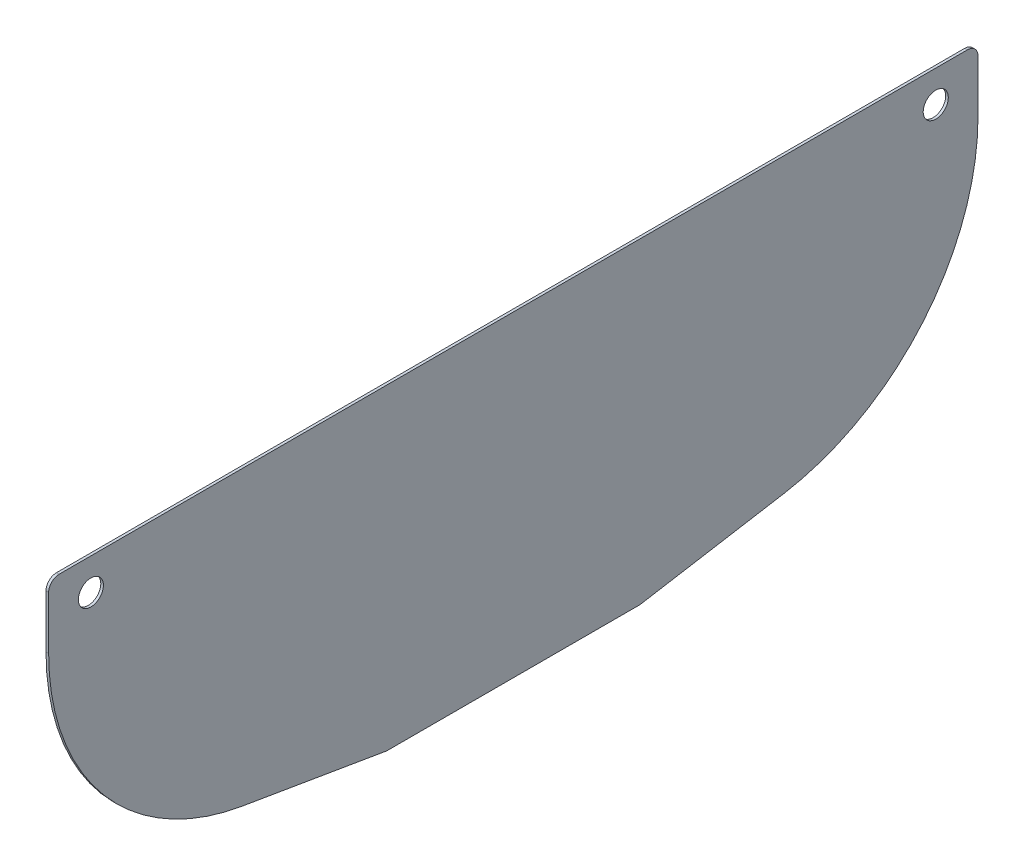
ISO-10303-21;
HEADER;
FILE_DESCRIPTION(('STEP AP214'),'2;1');
FILE_NAME('part.step','',(''),(''),'','','');
FILE_SCHEMA(('AUTOMOTIVE_DESIGN { 1 0 10303 214 1 1 1 1 }'));
ENDSEC;
DATA;
#1=APPLICATION_CONTEXT('core data for automotive mechanical design processes');
#2=APPLICATION_PROTOCOL_DEFINITION('international standard','automotive_design',2000,#1);
#3=PRODUCT_CONTEXT('',#1,'mechanical');
#4=PRODUCT('Part','Part','',(#3));
#5=PRODUCT_RELATED_PRODUCT_CATEGORY('part','',(#4));
#6=PRODUCT_DEFINITION_FORMATION('','',#4);
#7=PRODUCT_DEFINITION_CONTEXT('part definition',#1,'design');
#8=PRODUCT_DEFINITION('design','',#6,#7);
#9=PRODUCT_DEFINITION_SHAPE('','',#8);
#10=(LENGTH_UNIT() NAMED_UNIT(*) SI_UNIT(.MILLI.,.METRE.));
#11=(NAMED_UNIT(*) PLANE_ANGLE_UNIT() SI_UNIT($,.RADIAN.));
#12=(NAMED_UNIT(*) SI_UNIT($,.STERADIAN.) SOLID_ANGLE_UNIT());
#13=UNCERTAINTY_MEASURE_WITH_UNIT(LENGTH_MEASURE(1.E-05),#10,'distance_accuracy_value','');
#14=(GEOMETRIC_REPRESENTATION_CONTEXT(3) GLOBAL_UNCERTAINTY_ASSIGNED_CONTEXT((#13)) GLOBAL_UNIT_ASSIGNED_CONTEXT((#10,
#11,#12)) REPRESENTATION_CONTEXT('',''));
#15=CARTESIAN_POINT('',(0.,0.,0.));
#16=DIRECTION('',(0.,0.,1.));
#17=DIRECTION('',(1.,0.,0.));
#18=AXIS2_PLACEMENT_3D('',#15,#16,#17);
#19=CARTESIAN_POINT('',(3.175,609.6,-279.4));
#20=DIRECTION('',(1.,0.,0.));
#21=DIRECTION('',(0.,0.,-1.));
#22=AXIS2_PLACEMENT_3D('',#19,#20,#21);
#23=PLANE('',#22);
#24=CARTESIAN_POINT('',(3.175,647.7,508.));
#25=DIRECTION('',(1.,0.,0.));
#26=DIRECTION('',(0.,0.,-1.));
#27=AXIS2_PLACEMENT_3D('',#24,#25,#26);
#28=CIRCLE('',#27,15.08125);
#29=CARTESIAN_POINT('',(3.175,647.7,492.91875));
#30=VERTEX_POINT('',#29);
#31=EDGE_CURVE('E243',#30,#30,#28,.T.);
#32=ORIENTED_EDGE('',*,*,#31,.F.);
#33=EDGE_LOOP('',(#32));
#34=FACE_BOUND('',#33,.T.);
#35=DIRECTION('',(0.,0.,-1.));
#36=VECTOR('',#35,1.);
#37=CARTESIAN_POINT('',(3.175,304.8,-152.4));
#38=LINE('',#37,#36);
#39=CARTESIAN_POINT('',(3.175,304.8,151.335296477196));
#40=VERTEX_POINT('',#39);
#41=CARTESIAN_POINT('',(3.175,304.8,-151.335296477196));
#42=VERTEX_POINT('',#41);
#43=EDGE_CURVE('E236',#40,#42,#38,.T.);
#44=ORIENTED_EDGE('',*,*,#43,.T.);
#45=CARTESIAN_POINT('',(3.175,317.5,-151.335296477196));
#46=DIRECTION('',(1.,0.,0.));
#47=DIRECTION('',(0.,0.,-1.));
#48=AXIS2_PLACEMENT_3D('',#45,#46,#47);
#49=CIRCLE('',#48,12.7);
#50=CARTESIAN_POINT('',(3.175,304.977272750754,-153.449841875385));
#51=VERTEX_POINT('',#50);
#52=EDGE_CURVE('E182',#42,#51,#49,.T.);
#53=ORIENTED_EDGE('',*,*,#52,.T.);
#54=DIRECTION('',(0.,0.166499637652699,-0.986041515688625));
#55=VECTOR('',#54,1.);
#56=CARTESIAN_POINT('',(3.175,304.8,-152.4));
#57=LINE('',#56,#55);
#58=CARTESIAN_POINT('',(3.175,334.100000516598,-325.919998760164));
#59=VERTEX_POINT('',#58);
#60=EDGE_CURVE('E145',#51,#59,#57,.T.);
#61=ORIENTED_EDGE('',*,*,#60,.T.);
#62=CARTESIAN_POINT('',(3.175,609.6,-279.4));
#63=DIRECTION('',(1.,0.,0.));
#64=DIRECTION('',(0.,0.,-1.));
#65=AXIS2_PLACEMENT_3D('',#62,#63,#64);
#66=CIRCLE('',#65,279.4);
#67=CARTESIAN_POINT('',(3.175,609.6,-558.8));
#68=VERTEX_POINT('',#67);
#69=EDGE_CURVE('E139',#59,#68,#66,.T.);
#70=ORIENTED_EDGE('',*,*,#69,.T.);
#71=DIRECTION('',(0.,1.,0.));
#72=VECTOR('',#71,1.);
#73=CARTESIAN_POINT('',(3.175,685.8,-558.8));
#74=LINE('',#73,#72);
#75=CARTESIAN_POINT('',(3.175,673.1,-558.8));
#76=VERTEX_POINT('',#75);
#77=EDGE_CURVE('E129',#68,#76,#74,.T.);
#78=ORIENTED_EDGE('',*,*,#77,.T.);
#79=CARTESIAN_POINT('',(3.175,673.1,-546.1));
#80=DIRECTION('',(1.,0.,0.));
#81=DIRECTION('',(0.,0.,-1.));
#82=AXIS2_PLACEMENT_3D('',#79,#80,#81);
#83=CIRCLE('',#82,12.7);
#84=CARTESIAN_POINT('',(3.175,685.8,-546.1));
#85=VERTEX_POINT('',#84);
#86=EDGE_CURVE('E178',#76,#85,#83,.T.);
#87=ORIENTED_EDGE('',*,*,#86,.T.);
#88=DIRECTION('',(0.,0.,1.));
#89=VECTOR('',#88,1.);
#90=CARTESIAN_POINT('',(3.175,685.8,558.8));
#91=LINE('',#90,#89);
#92=CARTESIAN_POINT('',(3.175,685.8,546.1));
#93=VERTEX_POINT('',#92);
#94=EDGE_CURVE('E138',#85,#93,#91,.T.);
#95=ORIENTED_EDGE('',*,*,#94,.T.);
#96=CARTESIAN_POINT('',(3.175,673.1,546.1));
#97=DIRECTION('',(1.,0.,0.));
#98=DIRECTION('',(0.,0.,-1.));
#99=AXIS2_PLACEMENT_3D('',#96,#97,#98);
#100=CIRCLE('',#99,12.7);
#101=CARTESIAN_POINT('',(3.175,673.1,558.8));
#102=VERTEX_POINT('',#101);
#103=EDGE_CURVE('E60',#93,#102,#100,.T.);
#104=ORIENTED_EDGE('',*,*,#103,.T.);
#105=DIRECTION('',(0.,-1.,0.));
#106=VECTOR('',#105,1.);
#107=CARTESIAN_POINT('',(3.175,609.6,558.8));
#108=LINE('',#107,#106);
#109=CARTESIAN_POINT('',(3.175,609.6,558.8));
#110=VERTEX_POINT('',#109);
#111=EDGE_CURVE('E257',#102,#110,#108,.T.);
#112=ORIENTED_EDGE('',*,*,#111,.T.);
#113=CARTESIAN_POINT('',(3.175,609.6,279.4));
#114=DIRECTION('',(1.,0.,0.));
#115=DIRECTION('',(0.,0.,1.));
#116=AXIS2_PLACEMENT_3D('',#113,#114,#115);
#117=CIRCLE('',#116,279.4);
#118=CARTESIAN_POINT('',(3.175,334.100000516598,325.919998760164));
#119=VERTEX_POINT('',#118);
#120=EDGE_CURVE('E240',#110,#119,#117,.T.);
#121=ORIENTED_EDGE('',*,*,#120,.T.);
#122=DIRECTION('',(0.,-0.166499637652699,-0.986041515688625));
#123=VECTOR('',#122,1.);
#124=CARTESIAN_POINT('',(3.175,304.8,152.4));
#125=LINE('',#124,#123);
#126=CARTESIAN_POINT('',(3.175,304.977272750754,153.449841875385));
#127=VERTEX_POINT('',#126);
#128=EDGE_CURVE('E223',#119,#127,#125,.T.);
#129=ORIENTED_EDGE('',*,*,#128,.T.);
#130=CARTESIAN_POINT('',(3.175,317.5,151.335296477196));
#131=DIRECTION('',(1.,0.,0.));
#132=DIRECTION('',(0.,0.,-1.));
#133=AXIS2_PLACEMENT_3D('',#130,#131,#132);
#134=CIRCLE('',#133,12.7);
#135=EDGE_CURVE('E180',#127,#40,#134,.T.);
#136=ORIENTED_EDGE('',*,*,#135,.T.);
#137=EDGE_LOOP('',(#44,#53,#61,#70,#78,#87,#95,#104,#112,#121,#129,#136));
#138=FACE_BOUND('',#137,.T.);
#139=CARTESIAN_POINT('',(3.175,647.7,-508.));
#140=DIRECTION('',(1.,0.,0.));
#141=DIRECTION('',(0.,0.,-1.));
#142=AXIS2_PLACEMENT_3D('',#139,#140,#141);
#143=CIRCLE('',#142,15.0812500000001);
#144=CARTESIAN_POINT('',(3.175,647.7,-523.08125));
#145=VERTEX_POINT('',#144);
#146=EDGE_CURVE('E250',#145,#145,#143,.T.);
#147=ORIENTED_EDGE('',*,*,#146,.F.);
#148=EDGE_LOOP('',(#147));
#149=FACE_BOUND('',#148,.T.);
#150=ADVANCED_FACE('F37',(#34,#138,#149),#23,.T.);
#151=CARTESIAN_POINT('',(0.,609.6,-279.4));
#152=DIRECTION('',(1.,0.,0.));
#153=DIRECTION('',(0.,0.,-1.));
#154=AXIS2_PLACEMENT_3D('',#151,#152,#153);
#155=PLANE('',#154);
#156=DIRECTION('',(0.,0.166499637652699,-0.986041515688625));
#157=VECTOR('',#156,1.);
#158=CARTESIAN_POINT('',(0.,304.8,-152.4));
#159=LINE('',#158,#157);
#160=CARTESIAN_POINT('',(0.,304.977272750754,-153.449841875385));
#161=VERTEX_POINT('',#160);
#162=CARTESIAN_POINT('',(0.,334.100000516598,-325.919998760164));
#163=VERTEX_POINT('',#162);
#164=EDGE_CURVE('E149',#161,#163,#159,.T.);
#165=ORIENTED_EDGE('',*,*,#164,.F.);
#166=CARTESIAN_POINT('',(0.,317.5,-151.335296477196));
#167=DIRECTION('',(1.,0.,0.));
#168=DIRECTION('',(0.,0.,-1.));
#169=AXIS2_PLACEMENT_3D('',#166,#167,#168);
#170=CIRCLE('',#169,12.7);
#171=CARTESIAN_POINT('',(0.,304.8,-151.335296477196));
#172=VERTEX_POINT('',#171);
#173=EDGE_CURVE('E170',#161,#172,#170,.F.);
#174=ORIENTED_EDGE('',*,*,#173,.T.);
#175=DIRECTION('',(0.,0.,-1.));
#176=VECTOR('',#175,1.);
#177=CARTESIAN_POINT('',(0.,304.8,-152.4));
#178=LINE('',#177,#176);
#179=CARTESIAN_POINT('',(0.,304.8,151.335296477196));
#180=VERTEX_POINT('',#179);
#181=EDGE_CURVE('E214',#180,#172,#178,.T.);
#182=ORIENTED_EDGE('',*,*,#181,.F.);
#183=CARTESIAN_POINT('',(0.,317.5,151.335296477196));
#184=DIRECTION('',(1.,0.,0.));
#185=DIRECTION('',(0.,0.,-1.));
#186=AXIS2_PLACEMENT_3D('',#183,#184,#185);
#187=CIRCLE('',#186,12.7);
#188=CARTESIAN_POINT('',(0.,304.977272750754,153.449841875385));
#189=VERTEX_POINT('',#188);
#190=EDGE_CURVE('E168',#180,#189,#187,.F.);
#191=ORIENTED_EDGE('',*,*,#190,.T.);
#192=DIRECTION('',(0.,-0.166499637652699,-0.986041515688625));
#193=VECTOR('',#192,1.);
#194=CARTESIAN_POINT('',(0.,304.8,152.4));
#195=LINE('',#194,#193);
#196=CARTESIAN_POINT('',(0.,334.100000516598,325.919998760164));
#197=VERTEX_POINT('',#196);
#198=EDGE_CURVE('E212',#197,#189,#195,.T.);
#199=ORIENTED_EDGE('',*,*,#198,.F.);
#200=CARTESIAN_POINT('',(0.,609.6,279.4));
#201=DIRECTION('',(1.,0.,0.));
#202=DIRECTION('',(0.,0.,1.));
#203=AXIS2_PLACEMENT_3D('',#200,#201,#202);
#204=CIRCLE('',#203,279.4);
#205=CARTESIAN_POINT('',(0.,609.6,558.8));
#206=VERTEX_POINT('',#205);
#207=EDGE_CURVE('E206',#206,#197,#204,.T.);
#208=ORIENTED_EDGE('',*,*,#207,.F.);
#209=DIRECTION('',(0.,-1.,0.));
#210=VECTOR('',#209,1.);
#211=CARTESIAN_POINT('',(0.,609.6,558.8));
#212=LINE('',#211,#210);
#213=CARTESIAN_POINT('',(0.,673.1,558.8));
#214=VERTEX_POINT('',#213);
#215=EDGE_CURVE('E203',#214,#206,#212,.T.);
#216=ORIENTED_EDGE('',*,*,#215,.F.);
#217=CARTESIAN_POINT('',(0.,673.1,546.1));
#218=DIRECTION('',(1.,0.,0.));
#219=DIRECTION('',(0.,0.,-1.));
#220=AXIS2_PLACEMENT_3D('',#217,#218,#219);
#221=CIRCLE('',#220,12.7);
#222=CARTESIAN_POINT('',(0.,685.8,546.1));
#223=VERTEX_POINT('',#222);
#224=EDGE_CURVE('E158',#214,#223,#221,.F.);
#225=ORIENTED_EDGE('',*,*,#224,.T.);
#226=DIRECTION('',(0.,0.,1.));
#227=VECTOR('',#226,1.);
#228=CARTESIAN_POINT('',(0.,685.8,558.8));
#229=LINE('',#228,#227);
#230=CARTESIAN_POINT('',(0.,685.8,-546.1));
#231=VERTEX_POINT('',#230);
#232=EDGE_CURVE('E195',#231,#223,#229,.T.);
#233=ORIENTED_EDGE('',*,*,#232,.F.);
#234=CARTESIAN_POINT('',(0.,673.1,-546.1));
#235=DIRECTION('',(1.,0.,0.));
#236=DIRECTION('',(0.,0.,-1.));
#237=AXIS2_PLACEMENT_3D('',#234,#235,#236);
#238=CIRCLE('',#237,12.7);
#239=CARTESIAN_POINT('',(0.,673.1,-558.8));
#240=VERTEX_POINT('',#239);
#241=EDGE_CURVE('E166',#231,#240,#238,.F.);
#242=ORIENTED_EDGE('',*,*,#241,.T.);
#243=DIRECTION('',(0.,1.,0.));
#244=VECTOR('',#243,1.);
#245=CARTESIAN_POINT('',(0.,685.8,-558.8));
#246=LINE('',#245,#244);
#247=CARTESIAN_POINT('',(0.,609.6,-558.8));
#248=VERTEX_POINT('',#247);
#249=EDGE_CURVE('E204',#248,#240,#246,.T.);
#250=ORIENTED_EDGE('',*,*,#249,.F.);
#251=CARTESIAN_POINT('',(0.,609.6,-279.4));
#252=DIRECTION('',(1.,0.,0.));
#253=DIRECTION('',(0.,0.,-1.));
#254=AXIS2_PLACEMENT_3D('',#251,#252,#253);
#255=CIRCLE('',#254,279.4);
#256=EDGE_CURVE('E153',#163,#248,#255,.T.);
#257=ORIENTED_EDGE('',*,*,#256,.F.);
#258=EDGE_LOOP('',(#165,#174,#182,#191,#199,#208,#216,#225,#233,#242,#250,#257));
#259=FACE_BOUND('',#258,.T.);
#260=CARTESIAN_POINT('',(0.,647.7,508.));
#261=DIRECTION('',(1.,0.,0.));
#262=DIRECTION('',(0.,0.,-1.));
#263=AXIS2_PLACEMENT_3D('',#260,#261,#262);
#264=CIRCLE('',#263,15.08125);
#265=CARTESIAN_POINT('',(0.,647.7,492.91875));
#266=VERTEX_POINT('',#265);
#267=EDGE_CURVE('E245',#266,#266,#264,.T.);
#268=ORIENTED_EDGE('',*,*,#267,.T.);
#269=EDGE_LOOP('',(#268));
#270=FACE_BOUND('',#269,.T.);
#271=CARTESIAN_POINT('',(0.,647.7,-508.));
#272=DIRECTION('',(1.,0.,0.));
#273=DIRECTION('',(0.,0.,-1.));
#274=AXIS2_PLACEMENT_3D('',#271,#272,#273);
#275=CIRCLE('',#274,15.0812500000001);
#276=CARTESIAN_POINT('',(0.,647.7,-523.08125));
#277=VERTEX_POINT('',#276);
#278=EDGE_CURVE('E253',#277,#277,#275,.T.);
#279=ORIENTED_EDGE('',*,*,#278,.T.);
#280=EDGE_LOOP('',(#279));
#281=FACE_BOUND('',#280,.T.);
#282=ADVANCED_FACE('F200',(#259,#270,#281),#155,.F.);
#283=CARTESIAN_POINT('',(3.175,609.6,-279.4));
#284=DIRECTION('',(-1.,0.,0.));
#285=DIRECTION('',(0.,0.,1.));
#286=AXIS2_PLACEMENT_3D('',#283,#284,#285);
#287=CYLINDRICAL_SURFACE('',#286,279.4);
#288=ORIENTED_EDGE('',*,*,#256,.T.);
#289=DIRECTION('',(-1.,0.,0.));
#290=VECTOR('',#289,1.);
#291=CARTESIAN_POINT('',(3.175,609.6,-558.8));
#292=LINE('',#291,#290);
#293=EDGE_CURVE('E134',#68,#248,#292,.T.);
#294=ORIENTED_EDGE('',*,*,#293,.F.);
#295=ORIENTED_EDGE('',*,*,#69,.F.);
#296=DIRECTION('',(-1.,0.,0.));
#297=VECTOR('',#296,1.);
#298=CARTESIAN_POINT('',(3.175,334.100000516598,-325.919998760164));
#299=LINE('',#298,#297);
#300=EDGE_CURVE('E218',#59,#163,#299,.T.);
#301=ORIENTED_EDGE('',*,*,#300,.T.);
#302=EDGE_LOOP('',(#288,#294,#295,#301));
#303=FACE_BOUND('',#302,.T.);
#304=ADVANCED_FACE('F151',(#303),#287,.T.);
#305=CARTESIAN_POINT('',(3.175,685.8,-558.8));
#306=DIRECTION('',(0.,0.,1.));
#307=DIRECTION('',(0.,-1.,0.));
#308=AXIS2_PLACEMENT_3D('',#305,#306,#307);
#309=PLANE('',#308);
#310=ORIENTED_EDGE('',*,*,#249,.T.);
#311=DIRECTION('',(-1.,0.,0.));
#312=VECTOR('',#311,1.);
#313=CARTESIAN_POINT('',(3.175,673.1,-558.8));
#314=LINE('',#313,#312);
#315=EDGE_CURVE('E45',#240,#76,#314,.F.);
#316=ORIENTED_EDGE('',*,*,#315,.T.);
#317=ORIENTED_EDGE('',*,*,#77,.F.);
#318=ORIENTED_EDGE('',*,*,#293,.T.);
#319=EDGE_LOOP('',(#310,#316,#317,#318));
#320=FACE_BOUND('',#319,.T.);
#321=ADVANCED_FACE('F132',(#320),#309,.F.);
#322=CARTESIAN_POINT('',(3.175,685.8,558.8));
#323=DIRECTION('',(0.,-1.,0.));
#324=DIRECTION('',(0.,0.,-1.));
#325=AXIS2_PLACEMENT_3D('',#322,#323,#324);
#326=PLANE('',#325);
#327=ORIENTED_EDGE('',*,*,#94,.F.);
#328=DIRECTION('',(-1.,0.,0.));
#329=VECTOR('',#328,1.);
#330=CARTESIAN_POINT('',(3.175,685.8,-546.1));
#331=LINE('',#330,#329);
#332=EDGE_CURVE('E187',#85,#231,#331,.T.);
#333=ORIENTED_EDGE('',*,*,#332,.T.);
#334=ORIENTED_EDGE('',*,*,#232,.T.);
#335=DIRECTION('',(-1.,0.,0.));
#336=VECTOR('',#335,1.);
#337=CARTESIAN_POINT('',(3.175,685.8,546.1));
#338=LINE('',#337,#336);
#339=EDGE_CURVE('E185',#223,#93,#338,.F.);
#340=ORIENTED_EDGE('',*,*,#339,.T.);
#341=EDGE_LOOP('',(#327,#333,#334,#340));
#342=FACE_BOUND('',#341,.T.);
#343=ADVANCED_FACE('F194',(#342),#326,.F.);
#344=CARTESIAN_POINT('',(3.175,609.6,558.8));
#345=DIRECTION('',(0.,0.,-1.));
#346=DIRECTION('',(0.,1.,0.));
#347=AXIS2_PLACEMENT_3D('',#344,#345,#346);
#348=PLANE('',#347);
#349=ORIENTED_EDGE('',*,*,#111,.F.);
#350=DIRECTION('',(-1.,0.,0.));
#351=VECTOR('',#350,1.);
#352=CARTESIAN_POINT('',(3.175,673.1,558.8));
#353=LINE('',#352,#351);
#354=EDGE_CURVE('E11',#102,#214,#353,.T.);
#355=ORIENTED_EDGE('',*,*,#354,.T.);
#356=ORIENTED_EDGE('',*,*,#215,.T.);
#357=DIRECTION('',(-1.,0.,0.));
#358=VECTOR('',#357,1.);
#359=CARTESIAN_POINT('',(3.175,609.6,558.8));
#360=LINE('',#359,#358);
#361=EDGE_CURVE('E155',#110,#206,#360,.T.);
#362=ORIENTED_EDGE('',*,*,#361,.F.);
#363=EDGE_LOOP('',(#349,#355,#356,#362));
#364=FACE_BOUND('',#363,.T.);
#365=ADVANCED_FACE('F261',(#364),#348,.F.);
#366=CARTESIAN_POINT('',(3.175,609.6,279.4));
#367=DIRECTION('',(-1.,0.,0.));
#368=DIRECTION('',(0.,0.,1.));
#369=AXIS2_PLACEMENT_3D('',#366,#367,#368);
#370=CYLINDRICAL_SURFACE('',#369,279.4);
#371=ORIENTED_EDGE('',*,*,#207,.T.);
#372=DIRECTION('',(-1.,0.,0.));
#373=VECTOR('',#372,1.);
#374=CARTESIAN_POINT('',(3.175,334.100000516598,325.919998760164));
#375=LINE('',#374,#373);
#376=EDGE_CURVE('E161',#119,#197,#375,.T.);
#377=ORIENTED_EDGE('',*,*,#376,.F.);
#378=ORIENTED_EDGE('',*,*,#120,.F.);
#379=ORIENTED_EDGE('',*,*,#361,.T.);
#380=EDGE_LOOP('',(#371,#377,#378,#379));
#381=FACE_BOUND('',#380,.T.);
#382=ADVANCED_FACE('F259',(#381),#370,.T.);
#383=CARTESIAN_POINT('',(3.175,304.8,152.4));
#384=DIRECTION('',(0.,0.986041515688625,-0.166499637652699));
#385=DIRECTION('',(0.,0.166499637652699,0.986041515688625));
#386=AXIS2_PLACEMENT_3D('',#383,#384,#385);
#387=PLANE('',#386);
#388=ORIENTED_EDGE('',*,*,#198,.T.);
#389=DIRECTION('',(-1.,0.,0.));
#390=VECTOR('',#389,1.);
#391=CARTESIAN_POINT('',(3.175,304.977272750754,153.449841875385));
#392=LINE('',#391,#390);
#393=EDGE_CURVE('E52',#189,#127,#392,.F.);
#394=ORIENTED_EDGE('',*,*,#393,.T.);
#395=ORIENTED_EDGE('',*,*,#128,.F.);
#396=ORIENTED_EDGE('',*,*,#376,.T.);
#397=EDGE_LOOP('',(#388,#394,#395,#396));
#398=FACE_BOUND('',#397,.T.);
#399=ADVANCED_FACE('F222',(#398),#387,.F.);
#400=CARTESIAN_POINT('',(3.175,304.8,-152.4));
#401=DIRECTION('',(0.,1.,0.));
#402=DIRECTION('',(0.,0.,1.));
#403=AXIS2_PLACEMENT_3D('',#400,#401,#402);
#404=PLANE('',#403);
#405=ORIENTED_EDGE('',*,*,#181,.T.);
#406=DIRECTION('',(-1.,0.,0.));
#407=VECTOR('',#406,1.);
#408=CARTESIAN_POINT('',(3.175,304.8,-151.335296477196));
#409=LINE('',#408,#407);
#410=EDGE_CURVE('E175',#172,#42,#409,.F.);
#411=ORIENTED_EDGE('',*,*,#410,.T.);
#412=ORIENTED_EDGE('',*,*,#43,.F.);
#413=DIRECTION('',(-1.,0.,0.));
#414=VECTOR('',#413,1.);
#415=CARTESIAN_POINT('',(3.175,304.8,151.335296477196));
#416=LINE('',#415,#414);
#417=EDGE_CURVE('E172',#40,#180,#416,.T.);
#418=ORIENTED_EDGE('',*,*,#417,.T.);
#419=EDGE_LOOP('',(#405,#411,#412,#418));
#420=FACE_BOUND('',#419,.T.);
#421=ADVANCED_FACE('F234',(#420),#404,.F.);
#422=CARTESIAN_POINT('',(3.175,304.8,-152.4));
#423=DIRECTION('',(0.,0.986041515688625,0.166499637652699));
#424=DIRECTION('',(0.,-0.166499637652699,0.986041515688625));
#425=AXIS2_PLACEMENT_3D('',#422,#423,#424);
#426=PLANE('',#425);
#427=ORIENTED_EDGE('',*,*,#60,.F.);
#428=DIRECTION('',(-1.,0.,0.));
#429=VECTOR('',#428,1.);
#430=CARTESIAN_POINT('',(3.175,304.977272750754,-153.449841875385));
#431=LINE('',#430,#429);
#432=EDGE_CURVE('E154',#51,#161,#431,.T.);
#433=ORIENTED_EDGE('',*,*,#432,.T.);
#434=ORIENTED_EDGE('',*,*,#164,.T.);
#435=ORIENTED_EDGE('',*,*,#300,.F.);
#436=EDGE_LOOP('',(#427,#433,#434,#435));
#437=FACE_BOUND('',#436,.T.);
#438=ADVANCED_FACE('F284',(#437),#426,.F.);
#439=CARTESIAN_POINT('',(3.175,647.7,508.));
#440=DIRECTION('',(-1.,0.,0.));
#441=DIRECTION('',(0.,0.,1.));
#442=AXIS2_PLACEMENT_3D('',#439,#440,#441);
#443=CYLINDRICAL_SURFACE('',#442,15.08125);
#444=ORIENTED_EDGE('',*,*,#31,.T.);
#445=EDGE_LOOP('',(#444));
#446=FACE_BOUND('',#445,.T.);
#447=ORIENTED_EDGE('',*,*,#267,.F.);
#448=EDGE_LOOP('',(#447));
#449=FACE_BOUND('',#448,.T.);
#450=ADVANCED_FACE('F281',(#446,#449),#443,.F.);
#451=CARTESIAN_POINT('',(3.175,647.7,-508.));
#452=DIRECTION('',(-1.,0.,0.));
#453=DIRECTION('',(0.,0.,1.));
#454=AXIS2_PLACEMENT_3D('',#451,#452,#453);
#455=CYLINDRICAL_SURFACE('',#454,15.0812500000001);
#456=ORIENTED_EDGE('',*,*,#146,.T.);
#457=EDGE_LOOP('',(#456));
#458=FACE_BOUND('',#457,.T.);
#459=ORIENTED_EDGE('',*,*,#278,.F.);
#460=EDGE_LOOP('',(#459));
#461=FACE_BOUND('',#460,.T.);
#462=ADVANCED_FACE('F303',(#458,#461),#455,.F.);
#463=CARTESIAN_POINT('',(3.175,317.5,-151.335296477196));
#464=DIRECTION('',(-1.,0.,0.));
#465=DIRECTION('',(0.,0.,1.));
#466=AXIS2_PLACEMENT_3D('',#463,#464,#465);
#467=CYLINDRICAL_SURFACE('',#466,12.7);
#468=ORIENTED_EDGE('',*,*,#52,.F.);
#469=ORIENTED_EDGE('',*,*,#410,.F.);
#470=ORIENTED_EDGE('',*,*,#173,.F.);
#471=ORIENTED_EDGE('',*,*,#432,.F.);
#472=EDGE_LOOP('',(#468,#469,#470,#471));
#473=FACE_BOUND('',#472,.T.);
#474=ADVANCED_FACE('F270',(#473),#467,.T.);
#475=CARTESIAN_POINT('',(3.175,317.5,151.335296477196));
#476=DIRECTION('',(-1.,0.,0.));
#477=DIRECTION('',(0.,0.,1.));
#478=AXIS2_PLACEMENT_3D('',#475,#476,#477);
#479=CYLINDRICAL_SURFACE('',#478,12.7);
#480=ORIENTED_EDGE('',*,*,#135,.F.);
#481=ORIENTED_EDGE('',*,*,#393,.F.);
#482=ORIENTED_EDGE('',*,*,#190,.F.);
#483=ORIENTED_EDGE('',*,*,#417,.F.);
#484=EDGE_LOOP('',(#480,#481,#482,#483));
#485=FACE_BOUND('',#484,.T.);
#486=ADVANCED_FACE('F231',(#485),#479,.T.);
#487=CARTESIAN_POINT('',(3.175,673.1,-546.1));
#488=DIRECTION('',(-1.,0.,0.));
#489=DIRECTION('',(0.,0.,1.));
#490=AXIS2_PLACEMENT_3D('',#487,#488,#489);
#491=CYLINDRICAL_SURFACE('',#490,12.7);
#492=ORIENTED_EDGE('',*,*,#86,.F.);
#493=ORIENTED_EDGE('',*,*,#315,.F.);
#494=ORIENTED_EDGE('',*,*,#241,.F.);
#495=ORIENTED_EDGE('',*,*,#332,.F.);
#496=EDGE_LOOP('',(#492,#493,#494,#495));
#497=FACE_BOUND('',#496,.T.);
#498=ADVANCED_FACE('F264',(#497),#491,.T.);
#499=CARTESIAN_POINT('',(3.175,673.1,546.1));
#500=DIRECTION('',(-1.,0.,0.));
#501=DIRECTION('',(0.,0.,1.));
#502=AXIS2_PLACEMENT_3D('',#499,#500,#501);
#503=CYLINDRICAL_SURFACE('',#502,12.7);
#504=ORIENTED_EDGE('',*,*,#103,.F.);
#505=ORIENTED_EDGE('',*,*,#339,.F.);
#506=ORIENTED_EDGE('',*,*,#224,.F.);
#507=ORIENTED_EDGE('',*,*,#354,.F.);
#508=EDGE_LOOP('',(#504,#505,#506,#507));
#509=FACE_BOUND('',#508,.T.);
#510=ADVANCED_FACE('F39',(#509),#503,.T.);
#511=CLOSED_SHELL('',(#150,#282,#304,#321,#343,#365,#382,#399,#421,#438,#450,#462,#474,#486,
#498,#510));
#512=MANIFOLD_SOLID_BREP('B2',#511);
#513=ADVANCED_BREP_SHAPE_REPRESENTATION('',(#18,#512),#14);
#514=SHAPE_DEFINITION_REPRESENTATION(#9,#513);
ENDSEC;
END-ISO-10303-21;
